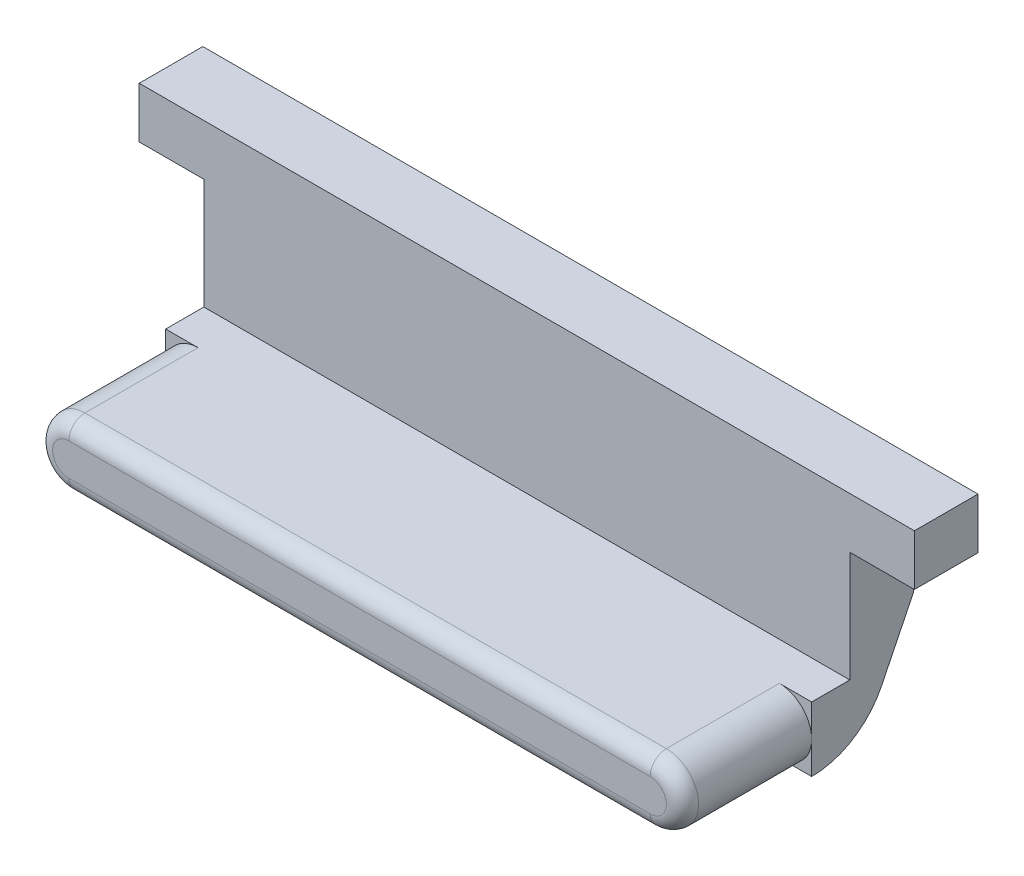
ISO-10303-21;
HEADER;
FILE_DESCRIPTION(('STEP AP214'),'2;1');
FILE_NAME('part.step','',(''),(''),'','','');
FILE_SCHEMA(('AUTOMOTIVE_DESIGN { 1 0 10303 214 1 1 1 1 }'));
ENDSEC;
DATA;
#1=APPLICATION_CONTEXT('core data for automotive mechanical design processes');
#2=APPLICATION_PROTOCOL_DEFINITION('international standard','automotive_design',2000,#1);
#3=PRODUCT_CONTEXT('',#1,'mechanical');
#4=PRODUCT('Part','Part','',(#3));
#5=PRODUCT_RELATED_PRODUCT_CATEGORY('part','',(#4));
#6=PRODUCT_DEFINITION_FORMATION('','',#4);
#7=PRODUCT_DEFINITION_CONTEXT('part definition',#1,'design');
#8=PRODUCT_DEFINITION('design','',#6,#7);
#9=PRODUCT_DEFINITION_SHAPE('','',#8);
#10=(LENGTH_UNIT() NAMED_UNIT(*) SI_UNIT(.MILLI.,.METRE.));
#11=(NAMED_UNIT(*) PLANE_ANGLE_UNIT() SI_UNIT($,.RADIAN.));
#12=(NAMED_UNIT(*) SI_UNIT($,.STERADIAN.) SOLID_ANGLE_UNIT());
#13=UNCERTAINTY_MEASURE_WITH_UNIT(LENGTH_MEASURE(1.E-05),#10,'distance_accuracy_value','');
#14=(GEOMETRIC_REPRESENTATION_CONTEXT(3) GLOBAL_UNCERTAINTY_ASSIGNED_CONTEXT((#13)) GLOBAL_UNIT_ASSIGNED_CONTEXT((#10,
#11,#12)) REPRESENTATION_CONTEXT('',''));
#15=CARTESIAN_POINT('',(0.,0.,0.));
#16=DIRECTION('',(0.,0.,1.));
#17=DIRECTION('',(1.,0.,0.));
#18=AXIS2_PLACEMENT_3D('',#15,#16,#17);
#19=CARTESIAN_POINT('',(-127.,216.547012861156,330.216510917726));
#20=DIRECTION('',(-1.,0.,0.));
#21=DIRECTION('',(0.,-1.,0.));
#22=AXIS2_PLACEMENT_3D('',#19,#20,#21);
#23=PLANE('',#22);
#24=DIRECTION('',(0.,-1.,0.));
#25=VECTOR('',#24,1.);
#26=CARTESIAN_POINT('',(-127.,190.5,340.6));
#27=LINE('',#26,#25);
#28=CARTESIAN_POINT('',(-127.,234.,340.6));
#29=VERTEX_POINT('',#28);
#30=CARTESIAN_POINT('',(-127.,190.5,340.6));
#31=VERTEX_POINT('',#30);
#32=EDGE_CURVE('E271',#29,#31,#27,.T.);
#33=ORIENTED_EDGE('',*,*,#32,.F.);
#34=DIRECTION('',(0.,0.,1.));
#35=VECTOR('',#34,1.);
#36=CARTESIAN_POINT('',(-127.,234.,315.5999992));
#37=LINE('',#36,#35);
#38=CARTESIAN_POINT('',(-127.,234.,315.5999992));
#39=VERTEX_POINT('',#38);
#40=EDGE_CURVE('E253',#39,#29,#37,.T.);
#41=ORIENTED_EDGE('',*,*,#40,.F.);
#42=DIRECTION('',(0.,1.,0.));
#43=VECTOR('',#42,1.);
#44=CARTESIAN_POINT('',(-127.,207.745235757354,315.5999992));
#45=LINE('',#44,#43);
#46=CARTESIAN_POINT('',(-127.,207.745235757354,315.5999992));
#47=VERTEX_POINT('',#46);
#48=EDGE_CURVE('E12',#47,#39,#45,.T.);
#49=ORIENTED_EDGE('',*,*,#48,.F.);
#50=DIRECTION('',(0.,-0.897542133073816,0.440928700990653));
#51=VECTOR('',#50,1.);
#52=CARTESIAN_POINT('',(-127.,165.1,336.55));
#53=LINE('',#52,#51);
#54=CARTESIAN_POINT('',(-127.,182.140493193805,328.17864644309));
#55=VERTEX_POINT('',#54);
#56=EDGE_CURVE('E276',#47,#55,#53,.T.);
#57=ORIENTED_EDGE('',*,*,#56,.T.);
#58=CARTESIAN_POINT('',(-127.,195.58,355.535730659179));
#59=DIRECTION('',(-1.,0.,0.));
#60=DIRECTION('',(0.,-1.,0.));
#61=AXIS2_PLACEMENT_3D('',#58,#59,#60);
#62=CIRCLE('',#61,30.4800000000001);
#63=CARTESIAN_POINT('',(-127.,165.1,355.535730659179));
#64=VERTEX_POINT('',#63);
#65=EDGE_CURVE('E281',#55,#64,#62,.T.);
#66=ORIENTED_EDGE('',*,*,#65,.T.);
#67=DIRECTION('',(0.,0.,1.));
#68=VECTOR('',#67,1.);
#69=CARTESIAN_POINT('',(-127.,165.1,406.4));
#70=LINE('',#69,#68);
#71=CARTESIAN_POINT('',(-127.,165.1,355.6));
#72=VERTEX_POINT('',#71);
#73=EDGE_CURVE('E284',#64,#72,#70,.T.);
#74=ORIENTED_EDGE('',*,*,#73,.T.);
#75=DIRECTION('',(0.,-1.,0.));
#76=VECTOR('',#75,1.);
#77=CARTESIAN_POINT('',(-127.,0.,355.6));
#78=LINE('',#77,#76);
#79=CARTESIAN_POINT('',(-127.,177.8,355.6));
#80=VERTEX_POINT('',#79);
#81=EDGE_CURVE('E282',#80,#72,#78,.T.);
#82=ORIENTED_EDGE('',*,*,#81,.F.);
#83=CARTESIAN_POINT('',(-127.,190.5,355.6));
#84=VERTEX_POINT('',#83);
#85=EDGE_CURVE('E278',#84,#80,#78,.T.);
#86=ORIENTED_EDGE('',*,*,#85,.F.);
#87=DIRECTION('',(0.,0.,-1.));
#88=VECTOR('',#87,1.);
#89=CARTESIAN_POINT('',(-127.,190.5,406.4));
#90=LINE('',#89,#88);
#91=EDGE_CURVE('E273',#84,#31,#90,.T.);
#92=ORIENTED_EDGE('',*,*,#91,.T.);
#93=EDGE_LOOP('',(#33,#41,#49,#57,#66,#74,#82,#86,#92));
#94=FACE_BOUND('',#93,.T.);
#95=ADVANCED_FACE('F41',(#94),#23,.T.);
#96=CARTESIAN_POINT('',(0.,0.,355.6));
#97=DIRECTION('',(0.,0.,1.));
#98=DIRECTION('',(1.,0.,0.));
#99=AXIS2_PLACEMENT_3D('',#96,#97,#98);
#100=PLANE('',#99);
#101=DIRECTION('',(-1.,0.,0.));
#102=VECTOR('',#101,1.);
#103=CARTESIAN_POINT('',(0.,190.5,355.6));
#104=LINE('',#103,#102);
#105=CARTESIAN_POINT('',(-114.3,190.5,355.6));
#106=VERTEX_POINT('',#105);
#107=EDGE_CURVE('E288',#106,#84,#104,.T.);
#108=ORIENTED_EDGE('',*,*,#107,.T.);
#109=ORIENTED_EDGE('',*,*,#85,.T.);
#110=CARTESIAN_POINT('',(-114.3,177.8,355.6));
#111=DIRECTION('',(0.,0.,1.));
#112=DIRECTION('',(1.,0.,0.));
#113=AXIS2_PLACEMENT_3D('',#110,#111,#112);
#114=CIRCLE('',#113,12.7);
#115=EDGE_CURVE('E303',#106,#80,#114,.T.);
#116=ORIENTED_EDGE('',*,*,#115,.F.);
#117=EDGE_LOOP('',(#108,#109,#116));
#118=FACE_BOUND('',#117,.T.);
#119=ADVANCED_FACE('F341',(#118),#100,.T.);
#120=CARTESIAN_POINT('',(-114.3,165.1,355.6));
#121=VERTEX_POINT('',#120);
#122=EDGE_CURVE('E307',#80,#121,#114,.T.);
#123=ORIENTED_EDGE('',*,*,#122,.F.);
#124=ORIENTED_EDGE('',*,*,#81,.T.);
#125=DIRECTION('',(1.,0.,0.));
#126=VECTOR('',#125,1.);
#127=CARTESIAN_POINT('',(-127.,165.1,355.6));
#128=LINE('',#127,#126);
#129=EDGE_CURVE('E300',#72,#121,#128,.T.);
#130=ORIENTED_EDGE('',*,*,#129,.T.);
#131=EDGE_LOOP('',(#123,#124,#130));
#132=FACE_BOUND('',#131,.T.);
#133=ADVANCED_FACE('F336',(#132),#100,.T.);
#134=CARTESIAN_POINT('',(-127.,165.1,336.55));
#135=DIRECTION('',(0.,0.440928700990653,0.897542133073816));
#136=DIRECTION('',(0.,-0.897542133073816,0.440928700990653));
#137=AXIS2_PLACEMENT_3D('',#134,#135,#136);
#138=PLANE('',#137);
#139=ORIENTED_EDGE('',*,*,#56,.F.);
#140=DIRECTION('',(1.,0.,0.));
#141=VECTOR('',#140,1.);
#142=CARTESIAN_POINT('',(-196.85,207.745235757354,315.5999992));
#143=LINE('',#142,#141);
#144=CARTESIAN_POINT('',(127.,207.745235757354,315.5999992));
#145=VERTEX_POINT('',#144);
#146=EDGE_CURVE('E292',#47,#145,#143,.T.);
#147=ORIENTED_EDGE('',*,*,#146,.T.);
#148=DIRECTION('',(0.,-0.897542133073816,0.440928700990653));
#149=VECTOR('',#148,1.);
#150=CARTESIAN_POINT('',(127.,165.1,336.55));
#151=LINE('',#150,#149);
#152=CARTESIAN_POINT('',(127.,182.140493193805,328.17864644309));
#153=VERTEX_POINT('',#152);
#154=EDGE_CURVE('E213',#145,#153,#151,.T.);
#155=ORIENTED_EDGE('',*,*,#154,.T.);
#156=DIRECTION('',(1.,0.,0.));
#157=VECTOR('',#156,1.);
#158=CARTESIAN_POINT('',(-159.230241468136,182.140493193805,328.178646443089));
#159=LINE('',#158,#157);
#160=EDGE_CURVE('E296',#55,#153,#159,.T.);
#161=ORIENTED_EDGE('',*,*,#160,.F.);
#162=EDGE_LOOP('',(#139,#147,#155,#161));
#163=FACE_BOUND('',#162,.T.);
#164=ADVANCED_FACE('F359',(#163),#138,.F.);
#165=CARTESIAN_POINT('',(-114.3,165.1,406.4));
#166=DIRECTION('',(0.,1.,0.));
#167=DIRECTION('',(-1.,0.,0.));
#168=AXIS2_PLACEMENT_3D('',#165,#166,#167);
#169=PLANE('',#168);
#170=ORIENTED_EDGE('',*,*,#73,.F.);
#171=DIRECTION('',(1.,0.,0.));
#172=VECTOR('',#171,1.);
#173=CARTESIAN_POINT('',(-159.230241468136,165.1,355.535730659179));
#174=LINE('',#173,#172);
#175=CARTESIAN_POINT('',(127.,165.1,355.535730659179));
#176=VERTEX_POINT('',#175);
#177=EDGE_CURVE('E298',#64,#176,#174,.T.);
#178=ORIENTED_EDGE('',*,*,#177,.T.);
#179=DIRECTION('',(0.,0.,1.));
#180=VECTOR('',#179,1.);
#181=CARTESIAN_POINT('',(127.,165.1,406.4));
#182=LINE('',#181,#180);
#183=CARTESIAN_POINT('',(127.,165.1,355.6));
#184=VERTEX_POINT('',#183);
#185=EDGE_CURVE('E223',#176,#184,#182,.T.);
#186=ORIENTED_EDGE('',*,*,#185,.T.);
#187=DIRECTION('',(-1.,0.,0.));
#188=VECTOR('',#187,1.);
#189=CARTESIAN_POINT('',(127.,165.1,355.6));
#190=LINE('',#189,#188);
#191=CARTESIAN_POINT('',(114.3,165.1,355.6));
#192=VERTEX_POINT('',#191);
#193=EDGE_CURVE('E228',#184,#192,#190,.T.);
#194=ORIENTED_EDGE('',*,*,#193,.T.);
#195=DIRECTION('',(0.,0.,-1.));
#196=VECTOR('',#195,1.);
#197=CARTESIAN_POINT('',(114.3,165.1,406.4));
#198=LINE('',#197,#196);
#199=CARTESIAN_POINT('',(114.3,165.1,400.05));
#200=VERTEX_POINT('',#199);
#201=EDGE_CURVE('E238',#200,#192,#198,.T.);
#202=ORIENTED_EDGE('',*,*,#201,.F.);
#203=DIRECTION('',(1.,0.,0.));
#204=VECTOR('',#203,1.);
#205=CARTESIAN_POINT('',(-114.3,165.1,400.05));
#206=LINE('',#205,#204);
#207=CARTESIAN_POINT('',(-114.3,165.1,400.05));
#208=VERTEX_POINT('',#207);
#209=EDGE_CURVE('E64',#200,#208,#206,.F.);
#210=ORIENTED_EDGE('',*,*,#209,.T.);
#211=DIRECTION('',(0.,0.,-1.));
#212=VECTOR('',#211,1.);
#213=CARTESIAN_POINT('',(-114.3,165.1,406.4));
#214=LINE('',#213,#212);
#215=EDGE_CURVE('E309',#208,#121,#214,.T.);
#216=ORIENTED_EDGE('',*,*,#215,.T.);
#217=ORIENTED_EDGE('',*,*,#129,.F.);
#218=EDGE_LOOP('',(#170,#178,#186,#194,#202,#210,#216,#217));
#219=FACE_BOUND('',#218,.T.);
#220=ADVANCED_FACE('F334',(#219),#169,.F.);
#221=CARTESIAN_POINT('',(-114.3,190.5,406.4));
#222=DIRECTION('',(0.,-1.,0.));
#223=DIRECTION('',(1.,0.,0.));
#224=AXIS2_PLACEMENT_3D('',#221,#222,#223);
#225=PLANE('',#224);
#226=ORIENTED_EDGE('',*,*,#91,.F.);
#227=ORIENTED_EDGE('',*,*,#107,.F.);
#228=DIRECTION('',(0.,0.,-1.));
#229=VECTOR('',#228,1.);
#230=CARTESIAN_POINT('',(-114.3,190.5,406.4));
#231=LINE('',#230,#229);
#232=CARTESIAN_POINT('',(-114.3,190.5,400.05));
#233=VERTEX_POINT('',#232);
#234=EDGE_CURVE('E306',#233,#106,#231,.T.);
#235=ORIENTED_EDGE('',*,*,#234,.F.);
#236=DIRECTION('',(-1.,0.,0.));
#237=VECTOR('',#236,1.);
#238=CARTESIAN_POINT('',(114.3,190.5,400.05));
#239=LINE('',#238,#237);
#240=CARTESIAN_POINT('',(114.3,190.5,400.05));
#241=VERTEX_POINT('',#240);
#242=EDGE_CURVE('E49',#233,#241,#239,.F.);
#243=ORIENTED_EDGE('',*,*,#242,.T.);
#244=DIRECTION('',(0.,0.,-1.));
#245=VECTOR('',#244,1.);
#246=CARTESIAN_POINT('',(114.3,190.5,406.4));
#247=LINE('',#246,#245);
#248=CARTESIAN_POINT('',(114.3,190.5,355.6));
#249=VERTEX_POINT('',#248);
#250=EDGE_CURVE('E235',#241,#249,#247,.T.);
#251=ORIENTED_EDGE('',*,*,#250,.T.);
#252=DIRECTION('',(1.,0.,0.));
#253=VECTOR('',#252,1.);
#254=CARTESIAN_POINT('',(0.,190.5,355.6));
#255=LINE('',#254,#253);
#256=CARTESIAN_POINT('',(127.,190.5,355.6));
#257=VERTEX_POINT('',#256);
#258=EDGE_CURVE('E226',#249,#257,#255,.T.);
#259=ORIENTED_EDGE('',*,*,#258,.T.);
#260=DIRECTION('',(0.,0.,-1.));
#261=VECTOR('',#260,1.);
#262=CARTESIAN_POINT('',(127.,190.5,406.4));
#263=LINE('',#262,#261);
#264=CARTESIAN_POINT('',(127.,190.5,340.6));
#265=VERTEX_POINT('',#264);
#266=EDGE_CURVE('E210',#257,#265,#263,.T.);
#267=ORIENTED_EDGE('',*,*,#266,.T.);
#268=DIRECTION('',(1.,0.,0.));
#269=VECTOR('',#268,1.);
#270=CARTESIAN_POINT('',(-196.85,190.5,340.6));
#271=LINE('',#270,#269);
#272=EDGE_CURVE('E286',#31,#265,#271,.T.);
#273=ORIENTED_EDGE('',*,*,#272,.F.);
#274=EDGE_LOOP('',(#226,#227,#235,#243,#251,#259,#267,#273));
#275=FACE_BOUND('',#274,.T.);
#276=ADVANCED_FACE('F343',(#275),#225,.F.);
#277=CARTESIAN_POINT('',(-159.230241468136,195.58,355.535730659179));
#278=DIRECTION('',(1.,0.,0.));
#279=DIRECTION('',(0.,0.,-1.));
#280=AXIS2_PLACEMENT_3D('',#277,#278,#279);
#281=CYLINDRICAL_SURFACE('',#280,30.4800000000001);
#282=ORIENTED_EDGE('',*,*,#65,.F.);
#283=ORIENTED_EDGE('',*,*,#160,.T.);
#284=CARTESIAN_POINT('',(127.,195.58,355.535730659179));
#285=DIRECTION('',(-1.,0.,0.));
#286=DIRECTION('',(0.,-1.,0.));
#287=AXIS2_PLACEMENT_3D('',#284,#285,#286);
#288=CIRCLE('',#287,30.4800000000001);
#289=EDGE_CURVE('E219',#153,#176,#288,.T.);
#290=ORIENTED_EDGE('',*,*,#289,.T.);
#291=ORIENTED_EDGE('',*,*,#177,.F.);
#292=EDGE_LOOP('',(#282,#283,#290,#291));
#293=FACE_BOUND('',#292,.T.);
#294=ADVANCED_FACE('F363',(#293),#281,.T.);
#295=CARTESIAN_POINT('',(-196.85,190.5,340.6));
#296=DIRECTION('',(0.,0.,1.));
#297=DIRECTION('',(1.,0.,0.));
#298=AXIS2_PLACEMENT_3D('',#295,#296,#297);
#299=PLANE('',#298);
#300=DIRECTION('',(1.,0.,0.));
#301=VECTOR('',#300,1.);
#302=CARTESIAN_POINT('',(-196.85,254.,340.6));
#303=LINE('',#302,#301);
#304=CARTESIAN_POINT('',(-152.4,254.,340.6));
#305=VERTEX_POINT('',#304);
#306=CARTESIAN_POINT('',(152.4,254.,340.6));
#307=VERTEX_POINT('',#306);
#308=EDGE_CURVE('E289',#305,#307,#303,.T.);
#309=ORIENTED_EDGE('',*,*,#308,.F.);
#310=DIRECTION('',(0.,1.,0.));
#311=VECTOR('',#310,1.);
#312=CARTESIAN_POINT('',(-152.4,254.,340.6));
#313=LINE('',#312,#311);
#314=CARTESIAN_POINT('',(-152.4,234.,340.6));
#315=VERTEX_POINT('',#314);
#316=EDGE_CURVE('E259',#315,#305,#313,.T.);
#317=ORIENTED_EDGE('',*,*,#316,.F.);
#318=DIRECTION('',(1.,0.,0.));
#319=VECTOR('',#318,1.);
#320=CARTESIAN_POINT('',(-152.4,234.,340.6));
#321=LINE('',#320,#319);
#322=EDGE_CURVE('E265',#315,#29,#321,.T.);
#323=ORIENTED_EDGE('',*,*,#322,.T.);
#324=ORIENTED_EDGE('',*,*,#32,.T.);
#325=ORIENTED_EDGE('',*,*,#272,.T.);
#326=DIRECTION('',(0.,-1.,0.));
#327=VECTOR('',#326,1.);
#328=CARTESIAN_POINT('',(127.,190.5,340.6));
#329=LINE('',#328,#327);
#330=CARTESIAN_POINT('',(127.,234.,340.6));
#331=VERTEX_POINT('',#330);
#332=EDGE_CURVE('E194',#331,#265,#329,.T.);
#333=ORIENTED_EDGE('',*,*,#332,.F.);
#334=DIRECTION('',(-1.,0.,0.));
#335=VECTOR('',#334,1.);
#336=CARTESIAN_POINT('',(152.4,234.,340.6));
#337=LINE('',#336,#335);
#338=CARTESIAN_POINT('',(152.4,234.,340.6));
#339=VERTEX_POINT('',#338);
#340=EDGE_CURVE('E195',#339,#331,#337,.T.);
#341=ORIENTED_EDGE('',*,*,#340,.F.);
#342=DIRECTION('',(0.,1.,0.));
#343=VECTOR('',#342,1.);
#344=CARTESIAN_POINT('',(152.4,254.,340.6));
#345=LINE('',#344,#343);
#346=EDGE_CURVE('E182',#339,#307,#345,.T.);
#347=ORIENTED_EDGE('',*,*,#346,.T.);
#348=EDGE_LOOP('',(#309,#317,#323,#324,#325,#333,#341,#347));
#349=FACE_BOUND('',#348,.T.);
#350=ADVANCED_FACE('F348',(#349),#299,.T.);
#351=CARTESIAN_POINT('',(-196.85,254.,340.6));
#352=DIRECTION('',(0.,1.,0.));
#353=DIRECTION('',(0.,0.,1.));
#354=AXIS2_PLACEMENT_3D('',#351,#352,#353);
#355=PLANE('',#354);
#356=DIRECTION('',(1.,0.,0.));
#357=VECTOR('',#356,1.);
#358=CARTESIAN_POINT('',(-196.85,254.,315.5999992));
#359=LINE('',#358,#357);
#360=CARTESIAN_POINT('',(-152.4,254.,315.5999992));
#361=VERTEX_POINT('',#360);
#362=CARTESIAN_POINT('',(152.4,254.,315.5999992));
#363=VERTEX_POINT('',#362);
#364=EDGE_CURVE('E200',#361,#363,#359,.T.);
#365=ORIENTED_EDGE('',*,*,#364,.F.);
#366=DIRECTION('',(0.,0.,-1.));
#367=VECTOR('',#366,1.);
#368=CARTESIAN_POINT('',(-152.4,254.,315.5999992));
#369=LINE('',#368,#367);
#370=EDGE_CURVE('E262',#305,#361,#369,.T.);
#371=ORIENTED_EDGE('',*,*,#370,.F.);
#372=ORIENTED_EDGE('',*,*,#308,.T.);
#373=DIRECTION('',(0.,0.,-1.));
#374=VECTOR('',#373,1.);
#375=CARTESIAN_POINT('',(152.4,254.,315.5999992));
#376=LINE('',#375,#374);
#377=EDGE_CURVE('E205',#307,#363,#376,.T.);
#378=ORIENTED_EDGE('',*,*,#377,.T.);
#379=EDGE_LOOP('',(#365,#371,#372,#378));
#380=FACE_BOUND('',#379,.T.);
#381=ADVANCED_FACE('F413',(#380),#355,.T.);
#382=CARTESIAN_POINT('',(-196.85,207.745235757354,315.5999992));
#383=DIRECTION('',(0.,0.,-1.));
#384=DIRECTION('',(-1.,0.,0.));
#385=AXIS2_PLACEMENT_3D('',#382,#383,#384);
#386=PLANE('',#385);
#387=ORIENTED_EDGE('',*,*,#146,.F.);
#388=ORIENTED_EDGE('',*,*,#48,.T.);
#389=DIRECTION('',(1.,0.,0.));
#390=VECTOR('',#389,1.);
#391=CARTESIAN_POINT('',(-152.4,234.,315.5999992));
#392=LINE('',#391,#390);
#393=CARTESIAN_POINT('',(-152.4,234.,315.5999992));
#394=VERTEX_POINT('',#393);
#395=EDGE_CURVE('E269',#394,#39,#392,.T.);
#396=ORIENTED_EDGE('',*,*,#395,.F.);
#397=DIRECTION('',(0.,-1.,0.));
#398=VECTOR('',#397,1.);
#399=CARTESIAN_POINT('',(-152.4,254.,315.5999992));
#400=LINE('',#399,#398);
#401=EDGE_CURVE('E254',#361,#394,#400,.T.);
#402=ORIENTED_EDGE('',*,*,#401,.F.);
#403=ORIENTED_EDGE('',*,*,#364,.T.);
#404=DIRECTION('',(0.,-1.,0.));
#405=VECTOR('',#404,1.);
#406=CARTESIAN_POINT('',(152.4,254.,315.5999992));
#407=LINE('',#406,#405);
#408=CARTESIAN_POINT('',(152.4,234.,315.5999992));
#409=VERTEX_POINT('',#408);
#410=EDGE_CURVE('E179',#363,#409,#407,.T.);
#411=ORIENTED_EDGE('',*,*,#410,.T.);
#412=DIRECTION('',(-1.,0.,0.));
#413=VECTOR('',#412,1.);
#414=CARTESIAN_POINT('',(152.4,234.,315.5999992));
#415=LINE('',#414,#413);
#416=CARTESIAN_POINT('',(127.,234.,315.5999992));
#417=VERTEX_POINT('',#416);
#418=EDGE_CURVE('E187',#409,#417,#415,.T.);
#419=ORIENTED_EDGE('',*,*,#418,.T.);
#420=DIRECTION('',(0.,1.,0.));
#421=VECTOR('',#420,1.);
#422=CARTESIAN_POINT('',(127.,207.745235757354,315.5999992));
#423=LINE('',#422,#421);
#424=EDGE_CURVE('E246',#145,#417,#423,.T.);
#425=ORIENTED_EDGE('',*,*,#424,.F.);
#426=EDGE_LOOP('',(#387,#388,#396,#402,#403,#411,#419,#425));
#427=FACE_BOUND('',#426,.T.);
#428=ADVANCED_FACE('F198',(#427),#386,.T.);
#429=CARTESIAN_POINT('',(-114.3,177.8,406.4));
#430=DIRECTION('',(0.,0.,1.));
#431=DIRECTION('',(1.,0.,0.));
#432=AXIS2_PLACEMENT_3D('',#429,#430,#431);
#433=PLANE('',#432);
#434=DIRECTION('',(1.,0.,0.));
#435=VECTOR('',#434,1.);
#436=CARTESIAN_POINT('',(114.3,171.45,406.4));
#437=LINE('',#436,#435);
#438=CARTESIAN_POINT('',(-114.3,171.45,406.4));
#439=VERTEX_POINT('',#438);
#440=CARTESIAN_POINT('',(114.3,171.45,406.4));
#441=VERTEX_POINT('',#440);
#442=EDGE_CURVE('E315',#439,#441,#437,.T.);
#443=ORIENTED_EDGE('',*,*,#442,.T.);
#444=CARTESIAN_POINT('',(114.3,177.8,406.4));
#445=DIRECTION('',(0.,0.,-1.));
#446=DIRECTION('',(-1.,0.,0.));
#447=AXIS2_PLACEMENT_3D('',#444,#445,#446);
#448=CIRCLE('',#447,6.34999999999996);
#449=CARTESIAN_POINT('',(114.3,184.15,406.4));
#450=VERTEX_POINT('',#449);
#451=EDGE_CURVE('E240',#450,#441,#448,.T.);
#452=ORIENTED_EDGE('',*,*,#451,.F.);
#453=DIRECTION('',(-1.,0.,0.));
#454=VECTOR('',#453,1.);
#455=CARTESIAN_POINT('',(-114.3,184.15,406.4));
#456=LINE('',#455,#454);
#457=CARTESIAN_POINT('',(-114.3,184.15,406.4));
#458=VERTEX_POINT('',#457);
#459=EDGE_CURVE('E311',#450,#458,#456,.T.);
#460=ORIENTED_EDGE('',*,*,#459,.T.);
#461=CARTESIAN_POINT('',(-114.3,177.8,406.4));
#462=DIRECTION('',(0.,0.,1.));
#463=DIRECTION('',(1.,0.,0.));
#464=AXIS2_PLACEMENT_3D('',#461,#462,#463);
#465=CIRCLE('',#464,6.34999999999996);
#466=EDGE_CURVE('E313',#458,#439,#465,.T.);
#467=ORIENTED_EDGE('',*,*,#466,.T.);
#468=EDGE_LOOP('',(#443,#452,#460,#467));
#469=FACE_BOUND('',#468,.T.);
#470=ADVANCED_FACE('F390',(#469),#433,.T.);
#471=CARTESIAN_POINT('',(-114.3,171.45,400.05));
#472=DIRECTION('',(-1.,0.,0.));
#473=DIRECTION('',(0.,-1.,0.));
#474=AXIS2_PLACEMENT_3D('',#471,#472,#473);
#475=CYLINDRICAL_SURFACE('',#474,6.35);
#476=ORIENTED_EDGE('',*,*,#209,.F.);
#477=CARTESIAN_POINT('',(114.3,171.45,400.05));
#478=DIRECTION('',(1.,0.,0.));
#479=DIRECTION('',(0.,0.,-1.));
#480=AXIS2_PLACEMENT_3D('',#477,#478,#479);
#481=CIRCLE('',#480,6.35);
#482=EDGE_CURVE('E249',#441,#200,#481,.T.);
#483=ORIENTED_EDGE('',*,*,#482,.F.);
#484=ORIENTED_EDGE('',*,*,#442,.F.);
#485=CARTESIAN_POINT('',(-114.3,171.45,400.05));
#486=DIRECTION('',(1.,0.,0.));
#487=DIRECTION('',(0.,0.,-1.));
#488=AXIS2_PLACEMENT_3D('',#485,#486,#487);
#489=CIRCLE('',#488,6.35);
#490=EDGE_CURVE('E321',#439,#208,#489,.T.);
#491=ORIENTED_EDGE('',*,*,#490,.T.);
#492=EDGE_LOOP('',(#476,#483,#484,#491));
#493=FACE_BOUND('',#492,.T.);
#494=ADVANCED_FACE('F388',(#493),#475,.T.);
#495=CARTESIAN_POINT('',(-114.3,184.15,400.05));
#496=DIRECTION('',(1.,0.,0.));
#497=DIRECTION('',(0.,1.,0.));
#498=AXIS2_PLACEMENT_3D('',#495,#496,#497);
#499=CYLINDRICAL_SURFACE('',#498,6.35);
#500=ORIENTED_EDGE('',*,*,#459,.F.);
#501=CARTESIAN_POINT('',(114.3,184.15,400.05));
#502=DIRECTION('',(1.,0.,0.));
#503=DIRECTION('',(0.,0.,-1.));
#504=AXIS2_PLACEMENT_3D('',#501,#502,#503);
#505=CIRCLE('',#504,6.35);
#506=EDGE_CURVE('E231',#241,#450,#505,.T.);
#507=ORIENTED_EDGE('',*,*,#506,.F.);
#508=ORIENTED_EDGE('',*,*,#242,.F.);
#509=CARTESIAN_POINT('',(-114.3,184.15,400.05));
#510=DIRECTION('',(1.,0.,0.));
#511=DIRECTION('',(0.,0.,-1.));
#512=AXIS2_PLACEMENT_3D('',#509,#510,#511);
#513=CIRCLE('',#512,6.35);
#514=EDGE_CURVE('E302',#233,#458,#513,.T.);
#515=ORIENTED_EDGE('',*,*,#514,.T.);
#516=EDGE_LOOP('',(#500,#507,#508,#515));
#517=FACE_BOUND('',#516,.T.);
#518=ADVANCED_FACE('F394',(#517),#499,.T.);
#519=CARTESIAN_POINT('',(-114.3,177.8,406.4));
#520=DIRECTION('',(0.,0.,-1.));
#521=DIRECTION('',(-1.,0.,0.));
#522=AXIS2_PLACEMENT_3D('',#519,#520,#521);
#523=CYLINDRICAL_SURFACE('',#522,12.7);
#524=CARTESIAN_POINT('',(-114.3,177.8,400.05));
#525=DIRECTION('',(0.,0.,1.));
#526=DIRECTION('',(1.,0.,0.));
#527=AXIS2_PLACEMENT_3D('',#524,#525,#526);
#528=CIRCLE('',#527,12.7);
#529=EDGE_CURVE('E56',#208,#233,#528,.F.);
#530=ORIENTED_EDGE('',*,*,#529,.T.);
#531=ORIENTED_EDGE('',*,*,#234,.T.);
#532=ORIENTED_EDGE('',*,*,#115,.T.);
#533=ORIENTED_EDGE('',*,*,#122,.T.);
#534=ORIENTED_EDGE('',*,*,#215,.F.);
#535=EDGE_LOOP('',(#530,#531,#532,#533,#534));
#536=FACE_BOUND('',#535,.T.);
#537=ADVANCED_FACE('F328',(#536),#523,.T.);
#538=CARTESIAN_POINT('',(-114.3,177.8,400.05));
#539=DIRECTION('',(0.,0.,1.));
#540=DIRECTION('',(1.,0.,0.));
#541=AXIS2_PLACEMENT_3D('',#538,#539,#540);
#542=DEGENERATE_TOROIDAL_SURFACE('',#541,6.34999999999996,6.35,.T.);
#543=ORIENTED_EDGE('',*,*,#514,.F.);
#544=ORIENTED_EDGE('',*,*,#529,.F.);
#545=ORIENTED_EDGE('',*,*,#490,.F.);
#546=ORIENTED_EDGE('',*,*,#466,.F.);
#547=EDGE_LOOP('',(#543,#544,#545,#546));
#548=FACE_BOUND('',#547,.T.);
#549=ADVANCED_FACE('F43',(#548),#542,.T.);
#550=CARTESIAN_POINT('',(-152.4,234.,315.5999992));
#551=DIRECTION('',(0.,1.,0.));
#552=DIRECTION('',(-1.,0.,0.));
#553=AXIS2_PLACEMENT_3D('',#550,#551,#552);
#554=PLANE('',#553);
#555=ORIENTED_EDGE('',*,*,#40,.T.);
#556=ORIENTED_EDGE('',*,*,#322,.F.);
#557=DIRECTION('',(0.,0.,1.));
#558=VECTOR('',#557,1.);
#559=CARTESIAN_POINT('',(-152.4,234.,315.5999992));
#560=LINE('',#559,#558);
#561=EDGE_CURVE('E257',#394,#315,#560,.T.);
#562=ORIENTED_EDGE('',*,*,#561,.F.);
#563=ORIENTED_EDGE('',*,*,#395,.T.);
#564=EDGE_LOOP('',(#555,#556,#562,#563));
#565=FACE_BOUND('',#564,.T.);
#566=ADVANCED_FACE('F353',(#565),#554,.F.);
#567=CARTESIAN_POINT('',(-152.4,0.,0.));
#568=DIRECTION('',(-1.,0.,0.));
#569=DIRECTION('',(0.,0.,1.));
#570=AXIS2_PLACEMENT_3D('',#567,#568,#569);
#571=PLANE('',#570);
#572=ORIENTED_EDGE('',*,*,#401,.T.);
#573=ORIENTED_EDGE('',*,*,#561,.T.);
#574=ORIENTED_EDGE('',*,*,#316,.T.);
#575=ORIENTED_EDGE('',*,*,#370,.T.);
#576=EDGE_LOOP('',(#572,#573,#574,#575));
#577=FACE_BOUND('',#576,.T.);
#578=ADVANCED_FACE('F476',(#577),#571,.T.);
#579=CARTESIAN_POINT('',(127.,216.547012861156,330.216510917726));
#580=DIRECTION('',(1.,0.,0.));
#581=DIRECTION('',(0.,-1.,0.));
#582=AXIS2_PLACEMENT_3D('',#579,#580,#581);
#583=PLANE('',#582);
#584=ORIENTED_EDGE('',*,*,#332,.T.);
#585=ORIENTED_EDGE('',*,*,#266,.F.);
#586=DIRECTION('',(0.,-1.,0.));
#587=VECTOR('',#586,1.);
#588=CARTESIAN_POINT('',(127.,0.,355.6));
#589=LINE('',#588,#587);
#590=CARTESIAN_POINT('',(127.,177.8,355.6));
#591=VERTEX_POINT('',#590);
#592=EDGE_CURVE('E216',#257,#591,#589,.T.);
#593=ORIENTED_EDGE('',*,*,#592,.T.);
#594=EDGE_CURVE('E220',#591,#184,#589,.T.);
#595=ORIENTED_EDGE('',*,*,#594,.T.);
#596=ORIENTED_EDGE('',*,*,#185,.F.);
#597=ORIENTED_EDGE('',*,*,#289,.F.);
#598=ORIENTED_EDGE('',*,*,#154,.F.);
#599=ORIENTED_EDGE('',*,*,#424,.T.);
#600=DIRECTION('',(0.,0.,1.));
#601=VECTOR('',#600,1.);
#602=CARTESIAN_POINT('',(127.,234.,315.5999992));
#603=LINE('',#602,#601);
#604=EDGE_CURVE('E190',#417,#331,#603,.T.);
#605=ORIENTED_EDGE('',*,*,#604,.T.);
#606=EDGE_LOOP('',(#584,#585,#593,#595,#596,#597,#598,#599,#605));
#607=FACE_BOUND('',#606,.T.);
#608=ADVANCED_FACE('F369',(#607),#583,.T.);
#609=CARTESIAN_POINT('',(0.,0.,355.6));
#610=DIRECTION('',(0.,0.,1.));
#611=DIRECTION('',(-1.,0.,0.));
#612=AXIS2_PLACEMENT_3D('',#609,#610,#611);
#613=PLANE('',#612);
#614=ORIENTED_EDGE('',*,*,#258,.F.);
#615=CARTESIAN_POINT('',(114.3,177.8,355.6));
#616=DIRECTION('',(0.,0.,-1.));
#617=DIRECTION('',(-1.,0.,0.));
#618=AXIS2_PLACEMENT_3D('',#615,#616,#617);
#619=CIRCLE('',#618,12.7);
#620=EDGE_CURVE('E232',#249,#591,#619,.T.);
#621=ORIENTED_EDGE('',*,*,#620,.T.);
#622=ORIENTED_EDGE('',*,*,#592,.F.);
#623=EDGE_LOOP('',(#614,#621,#622));
#624=FACE_BOUND('',#623,.T.);
#625=ADVANCED_FACE('F381',(#624),#613,.T.);
#626=EDGE_CURVE('E236',#591,#192,#619,.T.);
#627=ORIENTED_EDGE('',*,*,#626,.T.);
#628=ORIENTED_EDGE('',*,*,#193,.F.);
#629=ORIENTED_EDGE('',*,*,#594,.F.);
#630=EDGE_LOOP('',(#627,#628,#629));
#631=FACE_BOUND('',#630,.T.);
#632=ADVANCED_FACE('F373',(#631),#613,.T.);
#633=CARTESIAN_POINT('',(114.3,177.8,406.4));
#634=DIRECTION('',(0.,0.,-1.));
#635=DIRECTION('',(1.,0.,0.));
#636=AXIS2_PLACEMENT_3D('',#633,#634,#635);
#637=CYLINDRICAL_SURFACE('',#636,12.7);
#638=CARTESIAN_POINT('',(114.3,177.8,400.05));
#639=DIRECTION('',(0.,0.,-1.));
#640=DIRECTION('',(-1.,0.,0.));
#641=AXIS2_PLACEMENT_3D('',#638,#639,#640);
#642=CIRCLE('',#641,12.7);
#643=EDGE_CURVE('E243',#200,#241,#642,.F.);
#644=ORIENTED_EDGE('',*,*,#643,.F.);
#645=ORIENTED_EDGE('',*,*,#201,.T.);
#646=ORIENTED_EDGE('',*,*,#626,.F.);
#647=ORIENTED_EDGE('',*,*,#620,.F.);
#648=ORIENTED_EDGE('',*,*,#250,.F.);
#649=EDGE_LOOP('',(#644,#645,#646,#647,#648));
#650=FACE_BOUND('',#649,.T.);
#651=ADVANCED_FACE('F377',(#650),#637,.T.);
#652=CARTESIAN_POINT('',(114.3,177.8,400.05));
#653=DIRECTION('',(0.,0.,1.));
#654=DIRECTION('',(-1.,0.,0.));
#655=AXIS2_PLACEMENT_3D('',#652,#653,#654);
#656=DEGENERATE_TOROIDAL_SURFACE('',#655,6.34999999999996,6.35,.T.);
#657=ORIENTED_EDGE('',*,*,#506,.T.);
#658=ORIENTED_EDGE('',*,*,#451,.T.);
#659=ORIENTED_EDGE('',*,*,#482,.T.);
#660=ORIENTED_EDGE('',*,*,#643,.T.);
#661=EDGE_LOOP('',(#657,#658,#659,#660));
#662=FACE_BOUND('',#661,.T.);
#663=ADVANCED_FACE('F386',(#662),#656,.T.);
#664=CARTESIAN_POINT('',(152.4,234.,315.5999992));
#665=DIRECTION('',(0.,1.,0.));
#666=DIRECTION('',(1.,0.,0.));
#667=AXIS2_PLACEMENT_3D('',#664,#665,#666);
#668=PLANE('',#667);
#669=ORIENTED_EDGE('',*,*,#604,.F.);
#670=ORIENTED_EDGE('',*,*,#418,.F.);
#671=DIRECTION('',(0.,0.,1.));
#672=VECTOR('',#671,1.);
#673=CARTESIAN_POINT('',(152.4,234.,315.5999992));
#674=LINE('',#673,#672);
#675=EDGE_CURVE('E174',#409,#339,#674,.T.);
#676=ORIENTED_EDGE('',*,*,#675,.T.);
#677=ORIENTED_EDGE('',*,*,#340,.T.);
#678=EDGE_LOOP('',(#669,#670,#676,#677));
#679=FACE_BOUND('',#678,.T.);
#680=ADVANCED_FACE('F188',(#679),#668,.F.);
#681=CARTESIAN_POINT('',(152.4,0.,0.));
#682=DIRECTION('',(1.,0.,0.));
#683=DIRECTION('',(0.,0.,1.));
#684=AXIS2_PLACEMENT_3D('',#681,#682,#683);
#685=PLANE('',#684);
#686=ORIENTED_EDGE('',*,*,#410,.F.);
#687=ORIENTED_EDGE('',*,*,#377,.F.);
#688=ORIENTED_EDGE('',*,*,#346,.F.);
#689=ORIENTED_EDGE('',*,*,#675,.F.);
#690=EDGE_LOOP('',(#686,#687,#688,#689));
#691=FACE_BOUND('',#690,.T.);
#692=ADVANCED_FACE('F176',(#691),#685,.T.);
#693=CLOSED_SHELL('',(#95,#119,#133,#164,#220,#276,#294,#350,#381,#428,#470,#494,#518,#537,#549,
#566,#578,#608,#625,#632,#651,#663,#680,#692));
#694=MANIFOLD_SOLID_BREP('B2',#693);
#695=ADVANCED_BREP_SHAPE_REPRESENTATION('',(#18,#694),#14);
#696=SHAPE_DEFINITION_REPRESENTATION(#9,#695);
ENDSEC;
END-ISO-10303-21;
